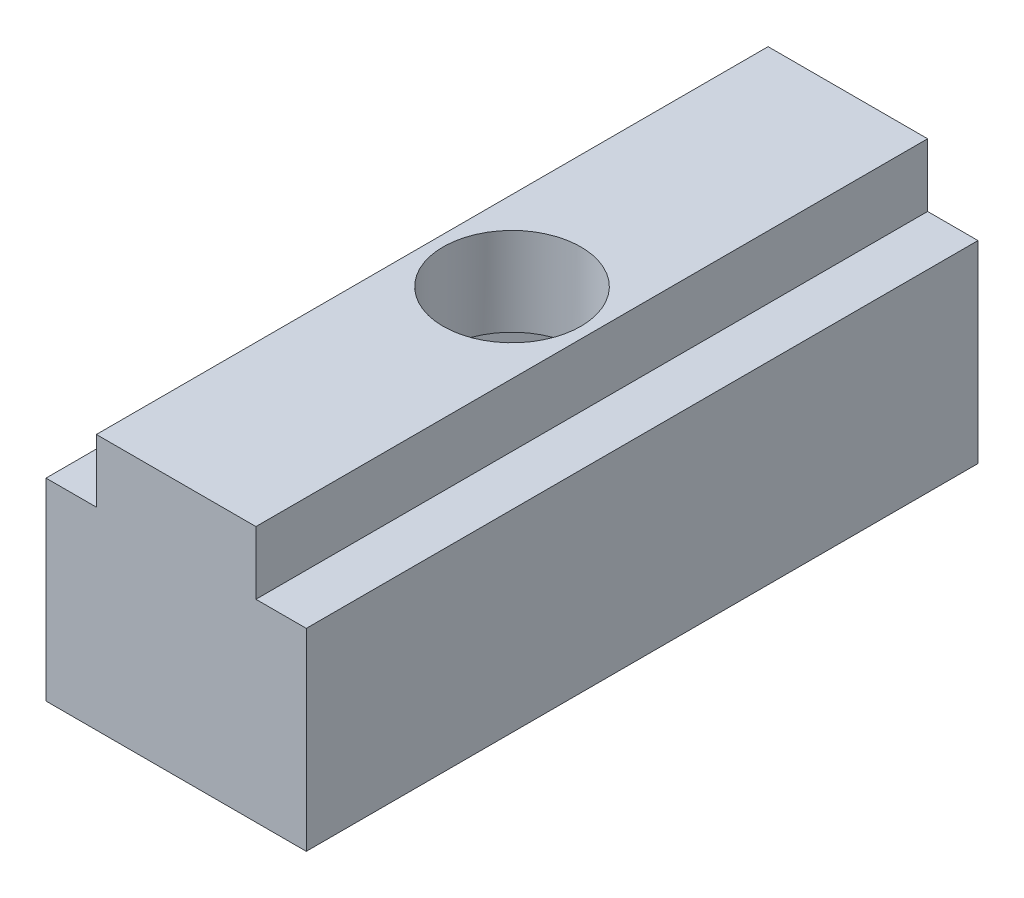
ISO-10303-21;
HEADER;
FILE_DESCRIPTION(('STEP AP214'),'2;1');
FILE_NAME('part.step','',(''),(''),'','','');
FILE_SCHEMA(('AUTOMOTIVE_DESIGN { 1 0 10303 214 1 1 1 1 }'));
ENDSEC;
DATA;
#1=APPLICATION_CONTEXT('core data for automotive mechanical design processes');
#2=APPLICATION_PROTOCOL_DEFINITION('international standard','automotive_design',2000,#1);
#3=PRODUCT_CONTEXT('',#1,'mechanical');
#4=PRODUCT('Part','Part','',(#3));
#5=PRODUCT_RELATED_PRODUCT_CATEGORY('part','',(#4));
#6=PRODUCT_DEFINITION_FORMATION('','',#4);
#7=PRODUCT_DEFINITION_CONTEXT('part definition',#1,'design');
#8=PRODUCT_DEFINITION('design','',#6,#7);
#9=PRODUCT_DEFINITION_SHAPE('','',#8);
#10=(LENGTH_UNIT() NAMED_UNIT(*) SI_UNIT(.MILLI.,.METRE.));
#11=(NAMED_UNIT(*) PLANE_ANGLE_UNIT() SI_UNIT($,.RADIAN.));
#12=(NAMED_UNIT(*) SI_UNIT($,.STERADIAN.) SOLID_ANGLE_UNIT());
#13=UNCERTAINTY_MEASURE_WITH_UNIT(LENGTH_MEASURE(1.E-05),#10,'distance_accuracy_value','');
#14=(GEOMETRIC_REPRESENTATION_CONTEXT(3) GLOBAL_UNCERTAINTY_ASSIGNED_CONTEXT((#13)) GLOBAL_UNIT_ASSIGNED_CONTEXT((#10,
#11,#12)) REPRESENTATION_CONTEXT('',''));
#15=CARTESIAN_POINT('',(0.,0.,0.));
#16=DIRECTION('',(0.,0.,1.));
#17=DIRECTION('',(1.,0.,0.));
#18=AXIS2_PLACEMENT_3D('',#15,#16,#17);
#19=CARTESIAN_POINT('',(-7.75,-0.000999999999999265,20.));
#20=DIRECTION('',(0.,1.,0.));
#21=DIRECTION('',(0.,0.,1.));
#22=AXIS2_PLACEMENT_3D('',#19,#20,#21);
#23=CYLINDRICAL_SURFACE('',#22,4.1);
#24=CARTESIAN_POINT('',(-7.75,15.25,20.));
#25=DIRECTION('',(0.,1.,0.));
#26=DIRECTION('',(0.,0.,1.));
#27=AXIS2_PLACEMENT_3D('',#24,#25,#26);
#28=CIRCLE('',#27,4.1);
#29=CARTESIAN_POINT('',(-7.75,15.25,24.1));
#30=VERTEX_POINT('',#29);
#31=EDGE_CURVE('E167',#30,#30,#28,.T.);
#32=ORIENTED_EDGE('',*,*,#31,.T.);
#33=EDGE_LOOP('',(#32));
#34=FACE_BOUND('',#33,.T.);
#35=CARTESIAN_POINT('',(-7.75,10.,20.));
#36=DIRECTION('',(0.,-1.,0.));
#37=DIRECTION('',(0.,0.,-1.));
#38=AXIS2_PLACEMENT_3D('',#35,#36,#37);
#39=CIRCLE('',#38,4.1);
#40=CARTESIAN_POINT('',(-7.75,10.,15.9));
#41=VERTEX_POINT('',#40);
#42=EDGE_CURVE('E51',#41,#41,#39,.F.);
#43=ORIENTED_EDGE('',*,*,#42,.F.);
#44=EDGE_LOOP('',(#43));
#45=FACE_BOUND('',#44,.T.);
#46=ADVANCED_FACE('F47',(#34,#45),#23,.F.);
#47=CARTESIAN_POINT('',(0.,11.5,40.));
#48=DIRECTION('',(-1.,0.,0.));
#49=DIRECTION('',(0.,0.,1.));
#50=AXIS2_PLACEMENT_3D('',#47,#48,#49);
#51=PLANE('',#50);
#52=DIRECTION('',(0.,1.,0.));
#53=VECTOR('',#52,1.);
#54=CARTESIAN_POINT('',(0.,11.5,0.));
#55=LINE('',#54,#53);
#56=CARTESIAN_POINT('',(0.,0.,0.));
#57=VERTEX_POINT('',#56);
#58=CARTESIAN_POINT('',(0.,11.5,0.));
#59=VERTEX_POINT('',#58);
#60=EDGE_CURVE('E162',#57,#59,#55,.T.);
#61=ORIENTED_EDGE('',*,*,#60,.T.);
#62=DIRECTION('',(0.,0.,-1.));
#63=VECTOR('',#62,1.);
#64=CARTESIAN_POINT('',(0.,11.5,40.));
#65=LINE('',#64,#63);
#66=CARTESIAN_POINT('',(0.,11.5,40.));
#67=VERTEX_POINT('',#66);
#68=EDGE_CURVE('E11',#67,#59,#65,.T.);
#69=ORIENTED_EDGE('',*,*,#68,.F.);
#70=DIRECTION('',(0.,1.,0.));
#71=VECTOR('',#70,1.);
#72=CARTESIAN_POINT('',(0.,11.5,40.));
#73=LINE('',#72,#71);
#74=CARTESIAN_POINT('',(0.,0.,40.));
#75=VERTEX_POINT('',#74);
#76=EDGE_CURVE('E186',#75,#67,#73,.T.);
#77=ORIENTED_EDGE('',*,*,#76,.F.);
#78=DIRECTION('',(0.,0.,-1.));
#79=VECTOR('',#78,1.);
#80=CARTESIAN_POINT('',(0.,0.,40.));
#81=LINE('',#80,#79);
#82=EDGE_CURVE('E158',#75,#57,#81,.T.);
#83=ORIENTED_EDGE('',*,*,#82,.T.);
#84=EDGE_LOOP('',(#61,#69,#77,#83));
#85=FACE_BOUND('',#84,.T.);
#86=ADVANCED_FACE('F49',(#85),#51,.F.);
#87=CARTESIAN_POINT('',(-3.,11.5,40.));
#88=DIRECTION('',(0.,-1.,0.));
#89=DIRECTION('',(0.,0.,-1.));
#90=AXIS2_PLACEMENT_3D('',#87,#88,#89);
#91=PLANE('',#90);
#92=DIRECTION('',(-1.,0.,0.));
#93=VECTOR('',#92,1.);
#94=CARTESIAN_POINT('',(-3.,11.5,0.));
#95=LINE('',#94,#93);
#96=CARTESIAN_POINT('',(-3.,11.5,0.));
#97=VERTEX_POINT('',#96);
#98=EDGE_CURVE('E166',#59,#97,#95,.T.);
#99=ORIENTED_EDGE('',*,*,#98,.T.);
#100=DIRECTION('',(0.,0.,-1.));
#101=VECTOR('',#100,1.);
#102=CARTESIAN_POINT('',(-3.,11.5,40.));
#103=LINE('',#102,#101);
#104=CARTESIAN_POINT('',(-3.,11.5,40.));
#105=VERTEX_POINT('',#104);
#106=EDGE_CURVE('E57',#105,#97,#103,.T.);
#107=ORIENTED_EDGE('',*,*,#106,.F.);
#108=DIRECTION('',(-1.,0.,0.));
#109=VECTOR('',#108,1.);
#110=CARTESIAN_POINT('',(-3.,11.5,40.));
#111=LINE('',#110,#109);
#112=EDGE_CURVE('E114',#67,#105,#111,.T.);
#113=ORIENTED_EDGE('',*,*,#112,.F.);
#114=ORIENTED_EDGE('',*,*,#68,.T.);
#115=EDGE_LOOP('',(#99,#107,#113,#114));
#116=FACE_BOUND('',#115,.T.);
#117=ADVANCED_FACE('F367',(#116),#91,.F.);
#118=CARTESIAN_POINT('',(-3.,15.25,40.));
#119=DIRECTION('',(-1.,0.,0.));
#120=DIRECTION('',(0.,0.,1.));
#121=AXIS2_PLACEMENT_3D('',#118,#119,#120);
#122=PLANE('',#121);
#123=DIRECTION('',(0.,1.,0.));
#124=VECTOR('',#123,1.);
#125=CARTESIAN_POINT('',(-3.,15.25,0.));
#126=LINE('',#125,#124);
#127=CARTESIAN_POINT('',(-3.,15.25,0.));
#128=VERTEX_POINT('',#127);
#129=EDGE_CURVE('E170',#97,#128,#126,.T.);
#130=ORIENTED_EDGE('',*,*,#129,.T.);
#131=DIRECTION('',(0.,0.,-1.));
#132=VECTOR('',#131,1.);
#133=CARTESIAN_POINT('',(-3.,15.25,40.));
#134=LINE('',#133,#132);
#135=CARTESIAN_POINT('',(-3.,15.25,40.));
#136=VERTEX_POINT('',#135);
#137=EDGE_CURVE('E197',#136,#128,#134,.T.);
#138=ORIENTED_EDGE('',*,*,#137,.F.);
#139=DIRECTION('',(0.,1.,0.));
#140=VECTOR('',#139,1.);
#141=CARTESIAN_POINT('',(-3.,15.25,40.));
#142=LINE('',#141,#140);
#143=EDGE_CURVE('E208',#105,#136,#142,.T.);
#144=ORIENTED_EDGE('',*,*,#143,.F.);
#145=ORIENTED_EDGE('',*,*,#106,.T.);
#146=EDGE_LOOP('',(#130,#138,#144,#145));
#147=FACE_BOUND('',#146,.T.);
#148=ADVANCED_FACE('F206',(#147),#122,.F.);
#149=CARTESIAN_POINT('',(-12.5,15.25,40.));
#150=DIRECTION('',(0.,-1.,0.));
#151=DIRECTION('',(0.,0.,-1.));
#152=AXIS2_PLACEMENT_3D('',#149,#150,#151);
#153=PLANE('',#152);
#154=ORIENTED_EDGE('',*,*,#31,.F.);
#155=EDGE_LOOP('',(#154));
#156=FACE_BOUND('',#155,.T.);
#157=DIRECTION('',(-1.,0.,0.));
#158=VECTOR('',#157,1.);
#159=CARTESIAN_POINT('',(-12.5,15.25,0.));
#160=LINE('',#159,#158);
#161=CARTESIAN_POINT('',(-12.5,15.25,0.));
#162=VERTEX_POINT('',#161);
#163=EDGE_CURVE('E173',#128,#162,#160,.T.);
#164=ORIENTED_EDGE('',*,*,#163,.T.);
#165=DIRECTION('',(0.,0.,-1.));
#166=VECTOR('',#165,1.);
#167=CARTESIAN_POINT('',(-12.5,15.25,40.));
#168=LINE('',#167,#166);
#169=CARTESIAN_POINT('',(-12.5,15.25,40.));
#170=VERTEX_POINT('',#169);
#171=EDGE_CURVE('E193',#170,#162,#168,.T.);
#172=ORIENTED_EDGE('',*,*,#171,.F.);
#173=DIRECTION('',(-1.,0.,0.));
#174=VECTOR('',#173,1.);
#175=CARTESIAN_POINT('',(-12.5,15.25,40.));
#176=LINE('',#175,#174);
#177=EDGE_CURVE('E221',#136,#170,#176,.T.);
#178=ORIENTED_EDGE('',*,*,#177,.F.);
#179=ORIENTED_EDGE('',*,*,#137,.T.);
#180=EDGE_LOOP('',(#164,#172,#178,#179));
#181=FACE_BOUND('',#180,.T.);
#182=ADVANCED_FACE('F216',(#156,#181),#153,.F.);
#183=CARTESIAN_POINT('',(-12.5,11.5,40.));
#184=DIRECTION('',(1.,0.,0.));
#185=DIRECTION('',(0.,0.,-1.));
#186=AXIS2_PLACEMENT_3D('',#183,#184,#185);
#187=PLANE('',#186);
#188=DIRECTION('',(0.,-1.,0.));
#189=VECTOR('',#188,1.);
#190=CARTESIAN_POINT('',(-12.5,11.5,0.));
#191=LINE('',#190,#189);
#192=CARTESIAN_POINT('',(-12.5,11.5,0.));
#193=VERTEX_POINT('',#192);
#194=EDGE_CURVE('E176',#162,#193,#191,.T.);
#195=ORIENTED_EDGE('',*,*,#194,.T.);
#196=DIRECTION('',(0.,0.,-1.));
#197=VECTOR('',#196,1.);
#198=CARTESIAN_POINT('',(-12.5,11.5,40.));
#199=LINE('',#198,#197);
#200=CARTESIAN_POINT('',(-12.5,11.5,40.));
#201=VERTEX_POINT('',#200);
#202=EDGE_CURVE('E151',#201,#193,#199,.T.);
#203=ORIENTED_EDGE('',*,*,#202,.F.);
#204=DIRECTION('',(0.,-1.,0.));
#205=VECTOR('',#204,1.);
#206=CARTESIAN_POINT('',(-12.5,11.5,40.));
#207=LINE('',#206,#205);
#208=EDGE_CURVE('E137',#170,#201,#207,.T.);
#209=ORIENTED_EDGE('',*,*,#208,.F.);
#210=ORIENTED_EDGE('',*,*,#171,.T.);
#211=EDGE_LOOP('',(#195,#203,#209,#210));
#212=FACE_BOUND('',#211,.T.);
#213=ADVANCED_FACE('F219',(#212),#187,.F.);
#214=CARTESIAN_POINT('',(-15.5,11.5,40.));
#215=DIRECTION('',(0.,-1.,0.));
#216=DIRECTION('',(0.,0.,-1.));
#217=AXIS2_PLACEMENT_3D('',#214,#215,#216);
#218=PLANE('',#217);
#219=DIRECTION('',(-1.,0.,0.));
#220=VECTOR('',#219,1.);
#221=CARTESIAN_POINT('',(-15.5,11.5,0.));
#222=LINE('',#221,#220);
#223=CARTESIAN_POINT('',(-15.5,11.5,0.));
#224=VERTEX_POINT('',#223);
#225=EDGE_CURVE('E147',#193,#224,#222,.T.);
#226=ORIENTED_EDGE('',*,*,#225,.T.);
#227=DIRECTION('',(0.,0.,-1.));
#228=VECTOR('',#227,1.);
#229=CARTESIAN_POINT('',(-15.5,11.5,40.));
#230=LINE('',#229,#228);
#231=CARTESIAN_POINT('',(-15.5,11.5,40.));
#232=VERTEX_POINT('',#231);
#233=EDGE_CURVE('E144',#232,#224,#230,.T.);
#234=ORIENTED_EDGE('',*,*,#233,.F.);
#235=DIRECTION('',(-1.,0.,0.));
#236=VECTOR('',#235,1.);
#237=CARTESIAN_POINT('',(-15.5,11.5,40.));
#238=LINE('',#237,#236);
#239=EDGE_CURVE('E130',#201,#232,#238,.T.);
#240=ORIENTED_EDGE('',*,*,#239,.F.);
#241=ORIENTED_EDGE('',*,*,#202,.T.);
#242=EDGE_LOOP('',(#226,#234,#240,#241));
#243=FACE_BOUND('',#242,.T.);
#244=ADVANCED_FACE('F145',(#243),#218,.F.);
#245=CARTESIAN_POINT('',(-15.5,0.,40.));
#246=DIRECTION('',(1.,0.,0.));
#247=DIRECTION('',(0.,0.,-1.));
#248=AXIS2_PLACEMENT_3D('',#245,#246,#247);
#249=PLANE('',#248);
#250=DIRECTION('',(0.,-1.,0.));
#251=VECTOR('',#250,1.);
#252=CARTESIAN_POINT('',(-15.5,0.,0.));
#253=LINE('',#252,#251);
#254=CARTESIAN_POINT('',(-15.5,0.,0.));
#255=VERTEX_POINT('',#254);
#256=EDGE_CURVE('E181',#224,#255,#253,.T.);
#257=ORIENTED_EDGE('',*,*,#256,.T.);
#258=DIRECTION('',(0.,0.,-1.));
#259=VECTOR('',#258,1.);
#260=CARTESIAN_POINT('',(-15.5,0.,40.));
#261=LINE('',#260,#259);
#262=CARTESIAN_POINT('',(-15.5,0.,40.));
#263=VERTEX_POINT('',#262);
#264=EDGE_CURVE('E152',#263,#255,#261,.T.);
#265=ORIENTED_EDGE('',*,*,#264,.F.);
#266=DIRECTION('',(0.,-1.,0.));
#267=VECTOR('',#266,1.);
#268=CARTESIAN_POINT('',(-15.5,0.,40.));
#269=LINE('',#268,#267);
#270=EDGE_CURVE('E134',#232,#263,#269,.T.);
#271=ORIENTED_EDGE('',*,*,#270,.F.);
#272=ORIENTED_EDGE('',*,*,#233,.T.);
#273=EDGE_LOOP('',(#257,#265,#271,#272));
#274=FACE_BOUND('',#273,.T.);
#275=ADVANCED_FACE('F154',(#274),#249,.F.);
#276=CARTESIAN_POINT('',(0.,0.,40.));
#277=DIRECTION('',(0.,1.,0.));
#278=DIRECTION('',(0.,0.,1.));
#279=AXIS2_PLACEMENT_3D('',#276,#277,#278);
#280=PLANE('',#279);
#281=DIRECTION('',(0.258461541850698,0.,0.966021548095155));
#282=VECTOR('',#281,1.);
#283=CARTESIAN_POINT('',(-2.44080840233882,0.,14.6947367725383));
#284=LINE('',#283,#282);
#285=CARTESIAN_POINT('',(-2.44080840233882,0.,14.6947367725383));
#286=VERTEX_POINT('',#285);
#287=CARTESIAN_POINT('',(-0.500911472424164,0.,21.9452631834026));
#288=VERTEX_POINT('',#287);
#289=EDGE_CURVE('E274',#286,#288,#284,.T.);
#290=ORIENTED_EDGE('',*,*,#289,.F.);
#291=DIRECTION('',(0.965829972178924,0.,0.259176512903578));
#292=VECTOR('',#291,1.);
#293=CARTESIAN_POINT('',(-9.68989692991466,0.,12.7494735891357));
#294=LINE('',#293,#292);
#295=CARTESIAN_POINT('',(-9.68989692991466,0.,12.7494735891357));
#296=VERTEX_POINT('',#295);
#297=EDGE_CURVE('E64',#296,#286,#294,.T.);
#298=ORIENTED_EDGE('',*,*,#297,.F.);
#299=DIRECTION('',(0.707368430328226,0.,-0.706845035191577));
#300=VECTOR('',#299,1.);
#301=CARTESIAN_POINT('',(-14.9990885275758,0.,18.0547368165974));
#302=LINE('',#301,#300);
#303=CARTESIAN_POINT('',(-14.9990885275758,0.,18.0547368165974));
#304=VERTEX_POINT('',#303);
#305=EDGE_CURVE('E257',#304,#296,#302,.T.);
#306=ORIENTED_EDGE('',*,*,#305,.F.);
#307=DIRECTION('',(-0.258461541850698,0.,-0.966021548095155));
#308=VECTOR('',#307,1.);
#309=CARTESIAN_POINT('',(-13.0591915976612,0.,25.3052632274617));
#310=LINE('',#309,#308);
#311=CARTESIAN_POINT('',(-13.0591915976612,0.,25.3052632274617));
#312=VERTEX_POINT('',#311);
#313=EDGE_CURVE('E262',#312,#304,#310,.T.);
#314=ORIENTED_EDGE('',*,*,#313,.F.);
#315=DIRECTION('',(-0.965829972178924,0.,-0.259176512903578));
#316=VECTOR('',#315,1.);
#317=CARTESIAN_POINT('',(-5.81010307008535,0.,27.2505264108643));
#318=LINE('',#317,#316);
#319=CARTESIAN_POINT('',(-5.81010307008535,0.,27.2505264108643));
#320=VERTEX_POINT('',#319);
#321=EDGE_CURVE('E266',#320,#312,#318,.T.);
#322=ORIENTED_EDGE('',*,*,#321,.F.);
#323=DIRECTION('',(-0.707368430328226,0.,0.706845035191577));
#324=VECTOR('',#323,1.);
#325=CARTESIAN_POINT('',(-0.500911472424164,0.,21.9452631834026));
#326=LINE('',#325,#324);
#327=EDGE_CURVE('E270',#288,#320,#326,.T.);
#328=ORIENTED_EDGE('',*,*,#327,.F.);
#329=EDGE_LOOP('',(#290,#298,#306,#314,#322,#328));
#330=FACE_BOUND('',#329,.T.);
#331=DIRECTION('',(1.,0.,0.));
#332=VECTOR('',#331,1.);
#333=CARTESIAN_POINT('',(0.,0.,0.));
#334=LINE('',#333,#332);
#335=EDGE_CURVE('E106',#255,#57,#334,.T.);
#336=ORIENTED_EDGE('',*,*,#335,.T.);
#337=ORIENTED_EDGE('',*,*,#82,.F.);
#338=DIRECTION('',(1.,0.,0.));
#339=VECTOR('',#338,1.);
#340=CARTESIAN_POINT('',(0.,0.,40.));
#341=LINE('',#340,#339);
#342=EDGE_CURVE('E73',#263,#75,#341,.T.);
#343=ORIENTED_EDGE('',*,*,#342,.F.);
#344=ORIENTED_EDGE('',*,*,#264,.T.);
#345=EDGE_LOOP('',(#336,#337,#343,#344));
#346=FACE_BOUND('',#345,.T.);
#347=ADVANCED_FACE('F336',(#330,#346),#280,.F.);
#348=CARTESIAN_POINT('',(0.,0.,40.));
#349=DIRECTION('',(0.,0.,-1.));
#350=DIRECTION('',(-1.,0.,0.));
#351=AXIS2_PLACEMENT_3D('',#348,#349,#350);
#352=PLANE('',#351);
#353=ORIENTED_EDGE('',*,*,#76,.T.);
#354=ORIENTED_EDGE('',*,*,#112,.T.);
#355=ORIENTED_EDGE('',*,*,#143,.T.);
#356=ORIENTED_EDGE('',*,*,#177,.T.);
#357=ORIENTED_EDGE('',*,*,#208,.T.);
#358=ORIENTED_EDGE('',*,*,#239,.T.);
#359=ORIENTED_EDGE('',*,*,#270,.T.);
#360=ORIENTED_EDGE('',*,*,#342,.T.);
#361=EDGE_LOOP('',(#353,#354,#355,#356,#357,#358,#359,#360));
#362=FACE_BOUND('',#361,.T.);
#363=ADVANCED_FACE('F132',(#362),#352,.F.);
#364=CARTESIAN_POINT('',(0.,0.,0.));
#365=DIRECTION('',(0.,0.,-1.));
#366=DIRECTION('',(-1.,0.,0.));
#367=AXIS2_PLACEMENT_3D('',#364,#365,#366);
#368=PLANE('',#367);
#369=ORIENTED_EDGE('',*,*,#60,.F.);
#370=ORIENTED_EDGE('',*,*,#335,.F.);
#371=ORIENTED_EDGE('',*,*,#256,.F.);
#372=ORIENTED_EDGE('',*,*,#225,.F.);
#373=ORIENTED_EDGE('',*,*,#194,.F.);
#374=ORIENTED_EDGE('',*,*,#163,.F.);
#375=ORIENTED_EDGE('',*,*,#129,.F.);
#376=ORIENTED_EDGE('',*,*,#98,.F.);
#377=EDGE_LOOP('',(#369,#370,#371,#372,#373,#374,#375,#376));
#378=FACE_BOUND('',#377,.T.);
#379=ADVANCED_FACE('F212',(#378),#368,.T.);
#380=CARTESIAN_POINT('',(0.,10.,0.));
#381=DIRECTION('',(0.,-1.,0.));
#382=DIRECTION('',(0.,0.,-1.));
#383=AXIS2_PLACEMENT_3D('',#380,#381,#382);
#384=PLANE('',#383);
#385=DIRECTION('',(0.965829972178924,0.,0.259176512903578));
#386=VECTOR('',#385,1.);
#387=CARTESIAN_POINT('',(-9.68989692991466,10.,12.7494735891357));
#388=LINE('',#387,#386);
#389=CARTESIAN_POINT('',(-9.68989692991466,10.,12.7494735891357));
#390=VERTEX_POINT('',#389);
#391=CARTESIAN_POINT('',(-2.44080840233882,10.,14.6947367725383));
#392=VERTEX_POINT('',#391);
#393=EDGE_CURVE('E261',#390,#392,#388,.T.);
#394=ORIENTED_EDGE('',*,*,#393,.T.);
#395=DIRECTION('',(0.258461541850698,0.,0.966021548095155));
#396=VECTOR('',#395,1.);
#397=CARTESIAN_POINT('',(-2.44080840233882,10.,14.6947367725383));
#398=LINE('',#397,#396);
#399=CARTESIAN_POINT('',(-0.500911472424164,10.,21.9452631834026));
#400=VERTEX_POINT('',#399);
#401=EDGE_CURVE('E295',#392,#400,#398,.T.);
#402=ORIENTED_EDGE('',*,*,#401,.T.);
#403=DIRECTION('',(-0.707368430328226,0.,0.706845035191577));
#404=VECTOR('',#403,1.);
#405=CARTESIAN_POINT('',(-0.500911472424164,10.,21.9452631834026));
#406=LINE('',#405,#404);
#407=CARTESIAN_POINT('',(-5.81010307008535,10.,27.2505264108643));
#408=VERTEX_POINT('',#407);
#409=EDGE_CURVE('E291',#400,#408,#406,.T.);
#410=ORIENTED_EDGE('',*,*,#409,.T.);
#411=DIRECTION('',(-0.965829972178924,0.,-0.259176512903578));
#412=VECTOR('',#411,1.);
#413=CARTESIAN_POINT('',(-5.81010307008535,10.,27.2505264108643));
#414=LINE('',#413,#412);
#415=CARTESIAN_POINT('',(-13.0591915976612,10.,25.3052632274617));
#416=VERTEX_POINT('',#415);
#417=EDGE_CURVE('E287',#408,#416,#414,.T.);
#418=ORIENTED_EDGE('',*,*,#417,.T.);
#419=DIRECTION('',(-0.258461541850698,0.,-0.966021548095155));
#420=VECTOR('',#419,1.);
#421=CARTESIAN_POINT('',(-13.0591915976612,10.,25.3052632274617));
#422=LINE('',#421,#420);
#423=CARTESIAN_POINT('',(-14.9990885275758,10.,18.0547368165974));
#424=VERTEX_POINT('',#423);
#425=EDGE_CURVE('E283',#416,#424,#422,.T.);
#426=ORIENTED_EDGE('',*,*,#425,.T.);
#427=DIRECTION('',(0.707368430328226,0.,-0.706845035191577));
#428=VECTOR('',#427,1.);
#429=CARTESIAN_POINT('',(-14.9990885275758,10.,18.0547368165974));
#430=LINE('',#429,#428);
#431=EDGE_CURVE('E238',#424,#390,#430,.T.);
#432=ORIENTED_EDGE('',*,*,#431,.T.);
#433=EDGE_LOOP('',(#394,#402,#410,#418,#426,#432));
#434=FACE_BOUND('',#433,.T.);
#435=ORIENTED_EDGE('',*,*,#42,.T.);
#436=EDGE_LOOP('',(#435));
#437=FACE_BOUND('',#436,.T.);
#438=ADVANCED_FACE('F304',(#434,#437),#384,.T.);
#439=CARTESIAN_POINT('',(-9.68989692991466,10.,12.7494735891357));
#440=DIRECTION('',(0.259176512903578,0.,-0.965829972178924));
#441=DIRECTION('',(-0.965829972178924,0.,-0.259176512903578));
#442=AXIS2_PLACEMENT_3D('',#439,#440,#441);
#443=PLANE('',#442);
#444=ORIENTED_EDGE('',*,*,#297,.T.);
#445=DIRECTION('',(0.,-1.,0.));
#446=VECTOR('',#445,1.);
#447=CARTESIAN_POINT('',(-2.44080840233882,10.,14.6947367725383));
#448=LINE('',#447,#446);
#449=EDGE_CURVE('E234',#392,#286,#448,.T.);
#450=ORIENTED_EDGE('',*,*,#449,.F.);
#451=ORIENTED_EDGE('',*,*,#393,.F.);
#452=DIRECTION('',(0.,-1.,0.));
#453=VECTOR('',#452,1.);
#454=CARTESIAN_POINT('',(-9.68989692991466,10.,12.7494735891357));
#455=LINE('',#454,#453);
#456=EDGE_CURVE('E254',#390,#296,#455,.T.);
#457=ORIENTED_EDGE('',*,*,#456,.T.);
#458=EDGE_LOOP('',(#444,#450,#451,#457));
#459=FACE_BOUND('',#458,.T.);
#460=ADVANCED_FACE('F310',(#459),#443,.F.);
#461=CARTESIAN_POINT('',(-14.9990885275758,10.,18.0547368165974));
#462=DIRECTION('',(-0.706845035191577,0.,-0.707368430328226));
#463=DIRECTION('',(-0.707368430328226,0.,0.706845035191577));
#464=AXIS2_PLACEMENT_3D('',#461,#462,#463);
#465=PLANE('',#464);
#466=ORIENTED_EDGE('',*,*,#305,.T.);
#467=ORIENTED_EDGE('',*,*,#456,.F.);
#468=ORIENTED_EDGE('',*,*,#431,.F.);
#469=DIRECTION('',(0.,-1.,0.));
#470=VECTOR('',#469,1.);
#471=CARTESIAN_POINT('',(-14.9990885275758,10.,18.0547368165974));
#472=LINE('',#471,#470);
#473=EDGE_CURVE('E250',#424,#304,#472,.T.);
#474=ORIENTED_EDGE('',*,*,#473,.T.);
#475=EDGE_LOOP('',(#466,#467,#468,#474));
#476=FACE_BOUND('',#475,.T.);
#477=ADVANCED_FACE('F326',(#476),#465,.F.);
#478=CARTESIAN_POINT('',(-13.0591915976612,10.,25.3052632274617));
#479=DIRECTION('',(-0.966021548095155,0.,0.258461541850698));
#480=DIRECTION('',(0.258461541850698,0.,0.966021548095155));
#481=AXIS2_PLACEMENT_3D('',#478,#479,#480);
#482=PLANE('',#481);
#483=ORIENTED_EDGE('',*,*,#313,.T.);
#484=ORIENTED_EDGE('',*,*,#473,.F.);
#485=ORIENTED_EDGE('',*,*,#425,.F.);
#486=DIRECTION('',(0.,-1.,0.));
#487=VECTOR('',#486,1.);
#488=CARTESIAN_POINT('',(-13.0591915976612,10.,25.3052632274617));
#489=LINE('',#488,#487);
#490=EDGE_CURVE('E246',#416,#312,#489,.T.);
#491=ORIENTED_EDGE('',*,*,#490,.T.);
#492=EDGE_LOOP('',(#483,#484,#485,#491));
#493=FACE_BOUND('',#492,.T.);
#494=ADVANCED_FACE('F331',(#493),#482,.F.);
#495=CARTESIAN_POINT('',(-5.81010307008535,10.,27.2505264108643));
#496=DIRECTION('',(-0.259176512903578,0.,0.965829972178924));
#497=DIRECTION('',(0.965829972178924,0.,0.259176512903578));
#498=AXIS2_PLACEMENT_3D('',#495,#496,#497);
#499=PLANE('',#498);
#500=ORIENTED_EDGE('',*,*,#321,.T.);
#501=ORIENTED_EDGE('',*,*,#490,.F.);
#502=ORIENTED_EDGE('',*,*,#417,.F.);
#503=DIRECTION('',(0.,-1.,0.));
#504=VECTOR('',#503,1.);
#505=CARTESIAN_POINT('',(-5.81010307008535,10.,27.2505264108643));
#506=LINE('',#505,#504);
#507=EDGE_CURVE('E242',#408,#320,#506,.T.);
#508=ORIENTED_EDGE('',*,*,#507,.T.);
#509=EDGE_LOOP('',(#500,#501,#502,#508));
#510=FACE_BOUND('',#509,.T.);
#511=ADVANCED_FACE('F350',(#510),#499,.F.);
#512=CARTESIAN_POINT('',(-0.500911472424164,10.,21.9452631834026));
#513=DIRECTION('',(0.706845035191577,0.,0.707368430328226));
#514=DIRECTION('',(0.707368430328226,0.,-0.706845035191577));
#515=AXIS2_PLACEMENT_3D('',#512,#513,#514);
#516=PLANE('',#515);
#517=ORIENTED_EDGE('',*,*,#327,.T.);
#518=ORIENTED_EDGE('',*,*,#507,.F.);
#519=ORIENTED_EDGE('',*,*,#409,.F.);
#520=DIRECTION('',(0.,-1.,0.));
#521=VECTOR('',#520,1.);
#522=CARTESIAN_POINT('',(-0.500911472424164,10.,21.9452631834026));
#523=LINE('',#522,#521);
#524=EDGE_CURVE('E237',#400,#288,#523,.T.);
#525=ORIENTED_EDGE('',*,*,#524,.T.);
#526=EDGE_LOOP('',(#517,#518,#519,#525));
#527=FACE_BOUND('',#526,.T.);
#528=ADVANCED_FACE('F346',(#527),#516,.F.);
#529=CARTESIAN_POINT('',(-2.44080840233882,10.,14.6947367725383));
#530=DIRECTION('',(0.966021548095155,0.,-0.258461541850698));
#531=DIRECTION('',(-0.258461541850698,0.,-0.966021548095155));
#532=AXIS2_PLACEMENT_3D('',#529,#530,#531);
#533=PLANE('',#532);
#534=ORIENTED_EDGE('',*,*,#289,.T.);
#535=ORIENTED_EDGE('',*,*,#524,.F.);
#536=ORIENTED_EDGE('',*,*,#401,.F.);
#537=ORIENTED_EDGE('',*,*,#449,.T.);
#538=EDGE_LOOP('',(#534,#535,#536,#537));
#539=FACE_BOUND('',#538,.T.);
#540=ADVANCED_FACE('F340',(#539),#533,.F.);
#541=CLOSED_SHELL('',(#46,#86,#117,#148,#182,#213,#244,#275,#347,#363,#379,#438,#460,#477,#494,
#511,#528,#540));
#542=MANIFOLD_SOLID_BREP('B2',#541);
#543=ADVANCED_BREP_SHAPE_REPRESENTATION('',(#18,#542),#14);
#544=SHAPE_DEFINITION_REPRESENTATION(#9,#543);
ENDSEC;
END-ISO-10303-21;
